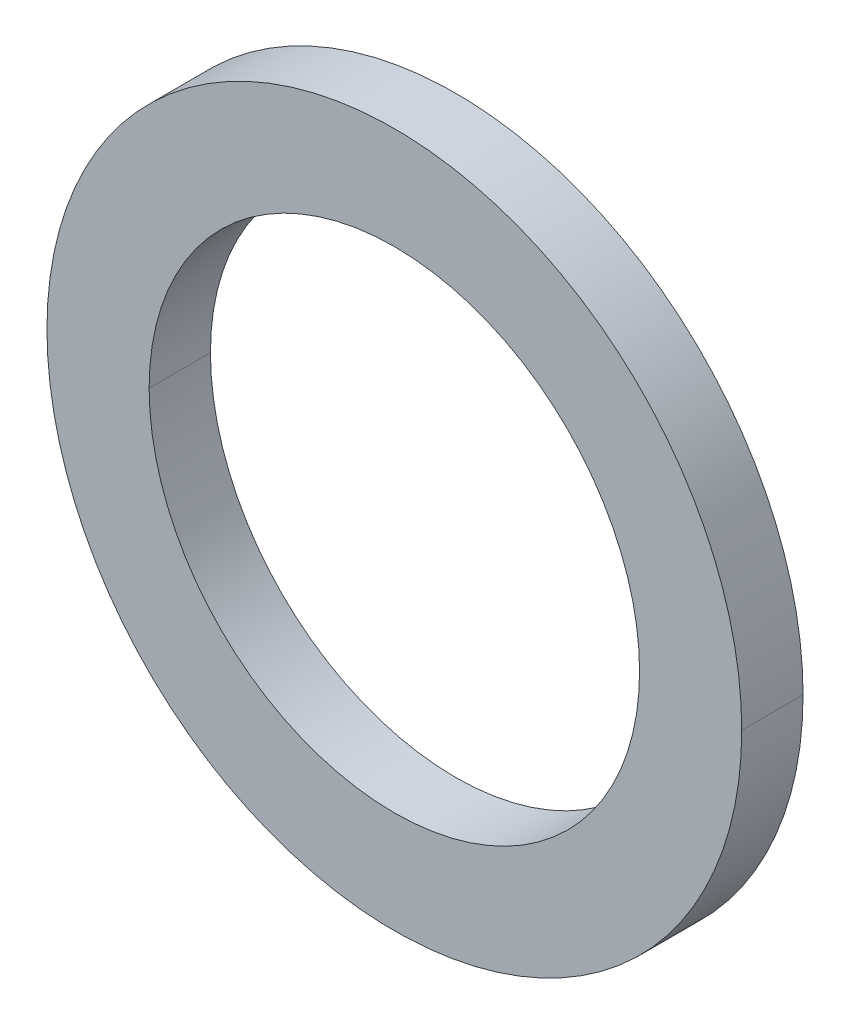
ISO-10303-21;
HEADER;
FILE_DESCRIPTION(('STEP AP214'),'2;1');
FILE_NAME('part.step','',(''),(''),'','','');
FILE_SCHEMA(('AUTOMOTIVE_DESIGN { 1 0 10303 214 1 1 1 1 }'));
ENDSEC;
DATA;
#1=APPLICATION_CONTEXT('core data for automotive mechanical design processes');
#2=APPLICATION_PROTOCOL_DEFINITION('international standard','automotive_design',2000,#1);
#3=PRODUCT_CONTEXT('',#1,'mechanical');
#4=PRODUCT('Part','Part','',(#3));
#5=PRODUCT_RELATED_PRODUCT_CATEGORY('part','',(#4));
#6=PRODUCT_DEFINITION_FORMATION('','',#4);
#7=PRODUCT_DEFINITION_CONTEXT('part definition',#1,'design');
#8=PRODUCT_DEFINITION('design','',#6,#7);
#9=PRODUCT_DEFINITION_SHAPE('','',#8);
#10=(LENGTH_UNIT() NAMED_UNIT(*) SI_UNIT(.MILLI.,.METRE.));
#11=(NAMED_UNIT(*) PLANE_ANGLE_UNIT() SI_UNIT($,.RADIAN.));
#12=(NAMED_UNIT(*) SI_UNIT($,.STERADIAN.) SOLID_ANGLE_UNIT());
#13=UNCERTAINTY_MEASURE_WITH_UNIT(LENGTH_MEASURE(1.E-05),#10,'distance_accuracy_value','');
#14=(GEOMETRIC_REPRESENTATION_CONTEXT(3) GLOBAL_UNCERTAINTY_ASSIGNED_CONTEXT((#13)) GLOBAL_UNIT_ASSIGNED_CONTEXT((#10,
#11,#12)) REPRESENTATION_CONTEXT('',''));
#15=CARTESIAN_POINT('',(0.,0.,0.));
#16=DIRECTION('',(0.,0.,1.));
#17=DIRECTION('',(1.,0.,0.));
#18=AXIS2_PLACEMENT_3D('',#15,#16,#17);
#19=CARTESIAN_POINT('',(0.,0.,1.5));
#20=DIRECTION('',(0.,0.,-1.));
#21=DIRECTION('',(-1.,0.,0.));
#22=AXIS2_PLACEMENT_3D('',#19,#20,#21);
#23=CYLINDRICAL_SURFACE('',#22,6.);
#24=DIRECTION('',(0.,0.,-1.));
#25=VECTOR('',#24,1.);
#26=CARTESIAN_POINT('',(6.,0.,1.5));
#27=LINE('',#26,#25);
#28=CARTESIAN_POINT('',(6.,0.,1.5));
#29=VERTEX_POINT('',#28);
#30=CARTESIAN_POINT('',(6.,0.,0.));
#31=VERTEX_POINT('',#30);
#32=EDGE_CURVE('E17',#29,#31,#27,.T.);
#33=ORIENTED_EDGE('',*,*,#32,.F.);
#34=CARTESIAN_POINT('',(0.,0.,1.5));
#35=DIRECTION('',(0.,0.,1.));
#36=DIRECTION('',(1.,0.,0.));
#37=AXIS2_PLACEMENT_3D('',#34,#35,#36);
#38=CIRCLE('',#37,6.);
#39=CARTESIAN_POINT('',(-6.,0.,1.5));
#40=VERTEX_POINT('',#39);
#41=EDGE_CURVE('E72',#29,#40,#38,.T.);
#42=ORIENTED_EDGE('',*,*,#41,.T.);
#43=DIRECTION('',(0.,0.,-1.));
#44=VECTOR('',#43,1.);
#45=CARTESIAN_POINT('',(-6.,0.,1.5));
#46=LINE('',#45,#44);
#47=CARTESIAN_POINT('',(-6.,0.,0.));
#48=VERTEX_POINT('',#47);
#49=EDGE_CURVE('E77',#40,#48,#46,.T.);
#50=ORIENTED_EDGE('',*,*,#49,.T.);
#51=CARTESIAN_POINT('',(0.,0.,0.));
#52=DIRECTION('',(0.,0.,1.));
#53=DIRECTION('',(1.,0.,0.));
#54=AXIS2_PLACEMENT_3D('',#51,#52,#53);
#55=CIRCLE('',#54,6.);
#56=EDGE_CURVE('E9',#31,#48,#55,.T.);
#57=ORIENTED_EDGE('',*,*,#56,.F.);
#58=EDGE_LOOP('',(#33,#42,#50,#57));
#59=FACE_BOUND('',#58,.T.);
#60=ADVANCED_FACE('F14',(#59),#23,.F.);
#61=CARTESIAN_POINT('',(0.,0.,1.5));
#62=DIRECTION('',(0.,0.,-1.));
#63=DIRECTION('',(-1.,0.,0.));
#64=AXIS2_PLACEMENT_3D('',#61,#62,#63);
#65=CYLINDRICAL_SURFACE('',#64,8.5);
#66=DIRECTION('',(0.,0.,-1.));
#67=VECTOR('',#66,1.);
#68=CARTESIAN_POINT('',(8.5,0.,1.5));
#69=LINE('',#68,#67);
#70=CARTESIAN_POINT('',(8.5,0.,1.5));
#71=VERTEX_POINT('',#70);
#72=CARTESIAN_POINT('',(8.5,0.,0.));
#73=VERTEX_POINT('',#72);
#74=EDGE_CURVE('E102',#71,#73,#69,.T.);
#75=ORIENTED_EDGE('',*,*,#74,.F.);
#76=CARTESIAN_POINT('',(0.,0.,1.5));
#77=DIRECTION('',(0.,0.,1.));
#78=DIRECTION('',(1.,0.,0.));
#79=AXIS2_PLACEMENT_3D('',#76,#77,#78);
#80=CIRCLE('',#79,8.5);
#81=CARTESIAN_POINT('',(-8.5,0.,1.5));
#82=VERTEX_POINT('',#81);
#83=EDGE_CURVE('E82',#82,#71,#80,.T.);
#84=ORIENTED_EDGE('',*,*,#83,.F.);
#85=DIRECTION('',(0.,0.,-1.));
#86=VECTOR('',#85,1.);
#87=CARTESIAN_POINT('',(-8.5,0.,1.5));
#88=LINE('',#87,#86);
#89=CARTESIAN_POINT('',(-8.5,0.,0.));
#90=VERTEX_POINT('',#89);
#91=EDGE_CURVE('E101',#82,#90,#88,.T.);
#92=ORIENTED_EDGE('',*,*,#91,.T.);
#93=CARTESIAN_POINT('',(0.,0.,0.));
#94=DIRECTION('',(0.,0.,1.));
#95=DIRECTION('',(1.,0.,0.));
#96=AXIS2_PLACEMENT_3D('',#93,#94,#95);
#97=CIRCLE('',#96,8.5);
#98=EDGE_CURVE('E23',#90,#73,#97,.T.);
#99=ORIENTED_EDGE('',*,*,#98,.T.);
#100=EDGE_LOOP('',(#75,#84,#92,#99));
#101=FACE_BOUND('',#100,.T.);
#102=ADVANCED_FACE('F129',(#101),#65,.T.);
#103=CARTESIAN_POINT('',(0.,0.,0.));
#104=DIRECTION('',(0.,0.,1.));
#105=DIRECTION('',(1.,0.,0.));
#106=AXIS2_PLACEMENT_3D('',#103,#104,#105);
#107=PLANE('',#106);
#108=CARTESIAN_POINT('',(0.,0.,0.));
#109=DIRECTION('',(0.,0.,1.));
#110=DIRECTION('',(1.,0.,0.));
#111=AXIS2_PLACEMENT_3D('',#108,#109,#110);
#112=CIRCLE('',#111,6.);
#113=EDGE_CURVE('E87',#48,#31,#112,.T.);
#114=ORIENTED_EDGE('',*,*,#113,.T.);
#115=ORIENTED_EDGE('',*,*,#56,.T.);
#116=EDGE_LOOP('',(#114,#115));
#117=FACE_BOUND('',#116,.T.);
#118=ORIENTED_EDGE('',*,*,#98,.F.);
#119=CARTESIAN_POINT('',(0.,0.,0.));
#120=DIRECTION('',(0.,0.,1.));
#121=DIRECTION('',(1.,0.,0.));
#122=AXIS2_PLACEMENT_3D('',#119,#120,#121);
#123=CIRCLE('',#122,8.5);
#124=EDGE_CURVE('E104',#73,#90,#123,.T.);
#125=ORIENTED_EDGE('',*,*,#124,.F.);
#126=EDGE_LOOP('',(#118,#125));
#127=FACE_BOUND('',#126,.T.);
#128=ADVANCED_FACE('F127',(#117,#127),#107,.F.);
#129=CARTESIAN_POINT('',(0.,0.,1.5));
#130=DIRECTION('',(0.,0.,1.));
#131=DIRECTION('',(1.,0.,0.));
#132=AXIS2_PLACEMENT_3D('',#129,#130,#131);
#133=PLANE('',#132);
#134=CARTESIAN_POINT('',(0.,0.,1.5));
#135=DIRECTION('',(0.,0.,1.));
#136=DIRECTION('',(1.,0.,0.));
#137=AXIS2_PLACEMENT_3D('',#134,#135,#136);
#138=CIRCLE('',#137,6.);
#139=EDGE_CURVE('E86',#40,#29,#138,.T.);
#140=ORIENTED_EDGE('',*,*,#139,.F.);
#141=ORIENTED_EDGE('',*,*,#41,.F.);
#142=EDGE_LOOP('',(#140,#141));
#143=FACE_BOUND('',#142,.T.);
#144=ORIENTED_EDGE('',*,*,#83,.T.);
#145=CARTESIAN_POINT('',(0.,0.,1.5));
#146=DIRECTION('',(0.,0.,1.));
#147=DIRECTION('',(1.,0.,0.));
#148=AXIS2_PLACEMENT_3D('',#145,#146,#147);
#149=CIRCLE('',#148,8.5);
#150=EDGE_CURVE('E89',#71,#82,#149,.T.);
#151=ORIENTED_EDGE('',*,*,#150,.T.);
#152=EDGE_LOOP('',(#144,#151));
#153=FACE_BOUND('',#152,.T.);
#154=ADVANCED_FACE('F91',(#143,#153),#133,.T.);
#155=CARTESIAN_POINT('',(0.,0.,1.5));
#156=DIRECTION('',(0.,0.,-1.));
#157=DIRECTION('',(-1.,0.,0.));
#158=AXIS2_PLACEMENT_3D('',#155,#156,#157);
#159=CYLINDRICAL_SURFACE('',#158,8.5);
#160=ORIENTED_EDGE('',*,*,#150,.F.);
#161=ORIENTED_EDGE('',*,*,#74,.T.);
#162=ORIENTED_EDGE('',*,*,#124,.T.);
#163=ORIENTED_EDGE('',*,*,#91,.F.);
#164=EDGE_LOOP('',(#160,#161,#162,#163));
#165=FACE_BOUND('',#164,.T.);
#166=ADVANCED_FACE('F136',(#165),#159,.T.);
#167=CARTESIAN_POINT('',(0.,0.,1.5));
#168=DIRECTION('',(0.,0.,-1.));
#169=DIRECTION('',(-1.,0.,0.));
#170=AXIS2_PLACEMENT_3D('',#167,#168,#169);
#171=CYLINDRICAL_SURFACE('',#170,6.);
#172=ORIENTED_EDGE('',*,*,#139,.T.);
#173=ORIENTED_EDGE('',*,*,#32,.T.);
#174=ORIENTED_EDGE('',*,*,#113,.F.);
#175=ORIENTED_EDGE('',*,*,#49,.F.);
#176=EDGE_LOOP('',(#172,#173,#174,#175));
#177=FACE_BOUND('',#176,.T.);
#178=ADVANCED_FACE('F85',(#177),#171,.F.);
#179=CLOSED_SHELL('',(#60,#102,#128,#154,#166,#178));
#180=MANIFOLD_SOLID_BREP('B1',#179);
#181=ADVANCED_BREP_SHAPE_REPRESENTATION('',(#18,#180),#14);
#182=SHAPE_DEFINITION_REPRESENTATION(#9,#181);
ENDSEC;
END-ISO-10303-21;
